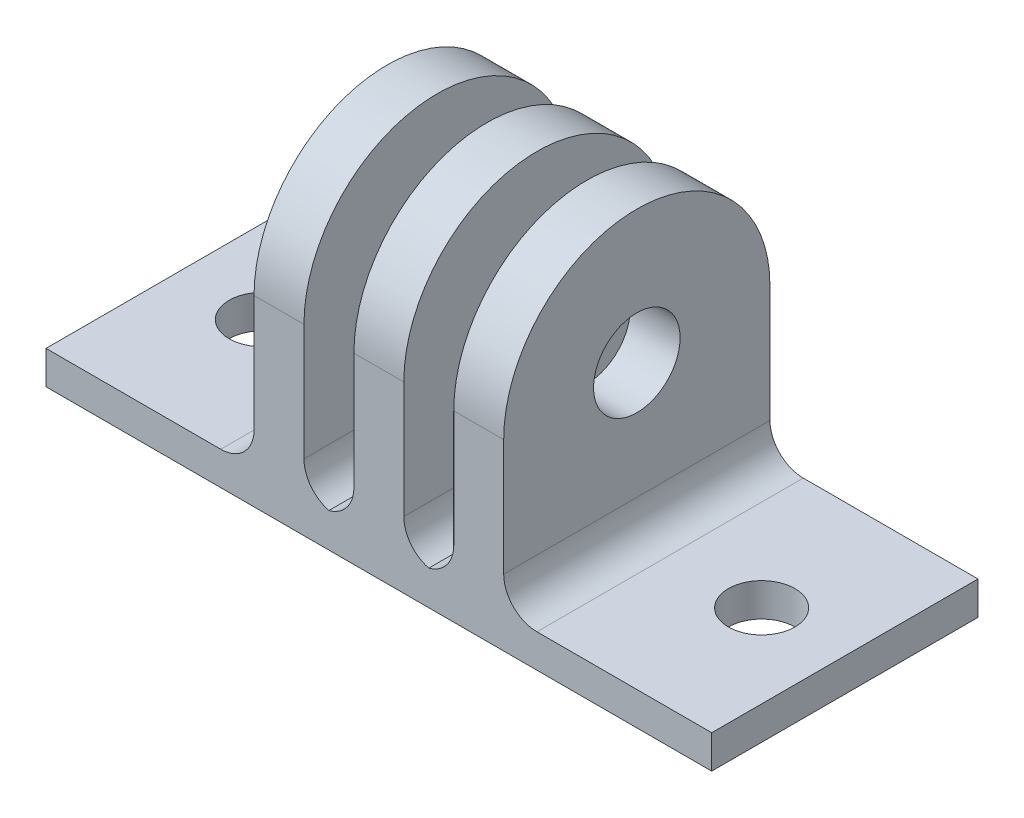
ISO-10303-21;
HEADER;
FILE_DESCRIPTION(('STEP AP214'),'2;1');
FILE_NAME('part.step','',(''),(''),'','','');
FILE_SCHEMA(('AUTOMOTIVE_DESIGN { 1 0 10303 214 1 1 1 1 }'));
ENDSEC;
DATA;
#1=APPLICATION_CONTEXT('core data for automotive mechanical design processes');
#2=APPLICATION_PROTOCOL_DEFINITION('international standard','automotive_design',2000,#1);
#3=PRODUCT_CONTEXT('',#1,'mechanical');
#4=PRODUCT('Part','Part','',(#3));
#5=PRODUCT_RELATED_PRODUCT_CATEGORY('part','',(#4));
#6=PRODUCT_DEFINITION_FORMATION('','',#4);
#7=PRODUCT_DEFINITION_CONTEXT('part definition',#1,'design');
#8=PRODUCT_DEFINITION('design','',#6,#7);
#9=PRODUCT_DEFINITION_SHAPE('','',#8);
#10=(LENGTH_UNIT() NAMED_UNIT(*) SI_UNIT(.MILLI.,.METRE.));
#11=(NAMED_UNIT(*) PLANE_ANGLE_UNIT() SI_UNIT($,.RADIAN.));
#12=(NAMED_UNIT(*) SI_UNIT($,.STERADIAN.) SOLID_ANGLE_UNIT());
#13=UNCERTAINTY_MEASURE_WITH_UNIT(LENGTH_MEASURE(1.E-05),#10,'distance_accuracy_value','');
#14=(GEOMETRIC_REPRESENTATION_CONTEXT(3) GLOBAL_UNCERTAINTY_ASSIGNED_CONTEXT((#13)) GLOBAL_UNIT_ASSIGNED_CONTEXT((#10,
#11,#12)) REPRESENTATION_CONTEXT('',''));
#15=CARTESIAN_POINT('',(0.,0.,0.));
#16=DIRECTION('',(0.,0.,1.));
#17=DIRECTION('',(1.,0.,0.));
#18=AXIS2_PLACEMENT_3D('',#15,#16,#17);
#19=CARTESIAN_POINT('',(0.,2.,0.));
#20=DIRECTION('',(0.,-1.,0.));
#21=DIRECTION('',(0.,0.,-1.));
#22=AXIS2_PLACEMENT_3D('',#19,#20,#21);
#23=PLANE('',#22);
#24=CARTESIAN_POINT('',(-15.,2.,0.));
#25=DIRECTION('',(0.,1.,0.));
#26=DIRECTION('',(0.,0.,1.));
#27=AXIS2_PLACEMENT_3D('',#24,#25,#26);
#28=CIRCLE('',#27,2.);
#29=CARTESIAN_POINT('',(-15.,2.,2.));
#30=VERTEX_POINT('',#29);
#31=EDGE_CURVE('E273',#30,#30,#28,.T.);
#32=ORIENTED_EDGE('',*,*,#31,.F.);
#33=EDGE_LOOP('',(#32));
#34=FACE_BOUND('',#33,.T.);
#35=DIRECTION('',(1.,0.,0.));
#36=VECTOR('',#35,1.);
#37=CARTESIAN_POINT('',(-20.,2.,8.));
#38=LINE('',#37,#36);
#39=CARTESIAN_POINT('',(-20.,2.,8.));
#40=VERTEX_POINT('',#39);
#41=CARTESIAN_POINT('',(-9.5,2.,8.));
#42=VERTEX_POINT('',#41);
#43=EDGE_CURVE('E290',#40,#42,#38,.T.);
#44=ORIENTED_EDGE('',*,*,#43,.T.);
#45=DIRECTION('',(0.,0.,1.));
#46=VECTOR('',#45,1.);
#47=CARTESIAN_POINT('',(-9.5,2.,-7.99999999999999));
#48=LINE('',#47,#46);
#49=CARTESIAN_POINT('',(-9.5,2.,-7.99999999999999));
#50=VERTEX_POINT('',#49);
#51=EDGE_CURVE('E315',#42,#50,#48,.F.);
#52=ORIENTED_EDGE('',*,*,#51,.T.);
#53=DIRECTION('',(-1.,0.,0.));
#54=VECTOR('',#53,1.);
#55=CARTESIAN_POINT('',(-20.,2.,-7.99999999999999));
#56=LINE('',#55,#54);
#57=CARTESIAN_POINT('',(-20.,2.,-7.99999999999999));
#58=VERTEX_POINT('',#57);
#59=EDGE_CURVE('E282',#50,#58,#56,.T.);
#60=ORIENTED_EDGE('',*,*,#59,.T.);
#61=DIRECTION('',(0.,0.,1.));
#62=VECTOR('',#61,1.);
#63=CARTESIAN_POINT('',(-20.,2.,8.));
#64=LINE('',#63,#62);
#65=EDGE_CURVE('E287',#58,#40,#64,.T.);
#66=ORIENTED_EDGE('',*,*,#65,.T.);
#67=EDGE_LOOP('',(#44,#52,#60,#66));
#68=FACE_BOUND('',#67,.T.);
#69=ADVANCED_FACE('F37',(#34,#68),#23,.F.);
#70=CARTESIAN_POINT('',(20.,2.,-7.99999999999999));
#71=VERTEX_POINT('',#70);
#72=CARTESIAN_POINT('',(9.5,2.,-7.99999999999999));
#73=VERTEX_POINT('',#72);
#74=EDGE_CURVE('E284',#71,#73,#56,.T.);
#75=ORIENTED_EDGE('',*,*,#74,.T.);
#76=DIRECTION('',(0.,0.,1.));
#77=VECTOR('',#76,1.);
#78=CARTESIAN_POINT('',(9.5,2.,0.));
#79=LINE('',#78,#77);
#80=CARTESIAN_POINT('',(9.5,2.,8.));
#81=VERTEX_POINT('',#80);
#82=EDGE_CURVE('E327',#73,#81,#79,.T.);
#83=ORIENTED_EDGE('',*,*,#82,.T.);
#84=CARTESIAN_POINT('',(20.,2.,7.99999999999999));
#85=VERTEX_POINT('',#84);
#86=EDGE_CURVE('E289',#81,#85,#38,.T.);
#87=ORIENTED_EDGE('',*,*,#86,.T.);
#88=DIRECTION('',(0.,0.,-1.));
#89=VECTOR('',#88,1.);
#90=CARTESIAN_POINT('',(20.,2.,7.99999999999999));
#91=LINE('',#90,#89);
#92=EDGE_CURVE('E279',#85,#71,#91,.T.);
#93=ORIENTED_EDGE('',*,*,#92,.T.);
#94=EDGE_LOOP('',(#75,#83,#87,#93));
#95=FACE_BOUND('',#94,.T.);
#96=CARTESIAN_POINT('',(15.,2.,0.));
#97=DIRECTION('',(0.,1.,0.));
#98=DIRECTION('',(0.,0.,-1.));
#99=AXIS2_PLACEMENT_3D('',#96,#97,#98);
#100=CIRCLE('',#99,2.);
#101=CARTESIAN_POINT('',(15.,2.,-2.));
#102=VERTEX_POINT('',#101);
#103=EDGE_CURVE('E267',#102,#102,#100,.T.);
#104=ORIENTED_EDGE('',*,*,#103,.F.);
#105=EDGE_LOOP('',(#104));
#106=FACE_BOUND('',#105,.T.);
#107=ADVANCED_FACE('F382',(#95,#106),#23,.F.);
#108=CARTESIAN_POINT('',(0.,0.,0.));
#109=DIRECTION('',(0.,-1.,0.));
#110=DIRECTION('',(0.,0.,-1.));
#111=AXIS2_PLACEMENT_3D('',#108,#109,#110);
#112=PLANE('',#111);
#113=CARTESIAN_POINT('',(-15.,0.,0.));
#114=DIRECTION('',(0.,1.,0.));
#115=DIRECTION('',(0.,0.,1.));
#116=AXIS2_PLACEMENT_3D('',#113,#114,#115);
#117=CIRCLE('',#116,2.);
#118=CARTESIAN_POINT('',(-15.,0.,2.));
#119=VERTEX_POINT('',#118);
#120=EDGE_CURVE('E270',#119,#119,#117,.T.);
#121=ORIENTED_EDGE('',*,*,#120,.T.);
#122=EDGE_LOOP('',(#121));
#123=FACE_BOUND('',#122,.T.);
#124=DIRECTION('',(0.,0.,-1.));
#125=VECTOR('',#124,1.);
#126=CARTESIAN_POINT('',(20.,0.,7.99999999999999));
#127=LINE('',#126,#125);
#128=CARTESIAN_POINT('',(20.,0.,7.99999999999999));
#129=VERTEX_POINT('',#128);
#130=CARTESIAN_POINT('',(20.,0.,-7.99999999999999));
#131=VERTEX_POINT('',#130);
#132=EDGE_CURVE('E276',#129,#131,#127,.T.);
#133=ORIENTED_EDGE('',*,*,#132,.F.);
#134=DIRECTION('',(1.,0.,0.));
#135=VECTOR('',#134,1.);
#136=CARTESIAN_POINT('',(-20.,0.,8.));
#137=LINE('',#136,#135);
#138=CARTESIAN_POINT('',(-20.,0.,8.));
#139=VERTEX_POINT('',#138);
#140=EDGE_CURVE('E283',#139,#129,#137,.T.);
#141=ORIENTED_EDGE('',*,*,#140,.F.);
#142=DIRECTION('',(0.,0.,1.));
#143=VECTOR('',#142,1.);
#144=CARTESIAN_POINT('',(-20.,0.,8.));
#145=LINE('',#144,#143);
#146=CARTESIAN_POINT('',(-20.,0.,-7.99999999999999));
#147=VERTEX_POINT('',#146);
#148=EDGE_CURVE('E298',#147,#139,#145,.T.);
#149=ORIENTED_EDGE('',*,*,#148,.F.);
#150=DIRECTION('',(-1.,0.,0.));
#151=VECTOR('',#150,1.);
#152=CARTESIAN_POINT('',(-20.,0.,-7.99999999999999));
#153=LINE('',#152,#151);
#154=EDGE_CURVE('E296',#131,#147,#153,.T.);
#155=ORIENTED_EDGE('',*,*,#154,.F.);
#156=EDGE_LOOP('',(#133,#141,#149,#155));
#157=FACE_BOUND('',#156,.T.);
#158=CARTESIAN_POINT('',(15.,0.,0.));
#159=DIRECTION('',(0.,1.,0.));
#160=DIRECTION('',(0.,0.,-1.));
#161=AXIS2_PLACEMENT_3D('',#158,#159,#160);
#162=CIRCLE('',#161,2.);
#163=CARTESIAN_POINT('',(15.,0.,-2.));
#164=VERTEX_POINT('',#163);
#165=EDGE_CURVE('E266',#164,#164,#162,.T.);
#166=ORIENTED_EDGE('',*,*,#165,.T.);
#167=EDGE_LOOP('',(#166));
#168=FACE_BOUND('',#167,.T.);
#169=ADVANCED_FACE('F388',(#123,#157,#168),#112,.T.);
#170=CARTESIAN_POINT('',(20.,2.,7.99999999999999));
#171=DIRECTION('',(-1.,0.,0.));
#172=DIRECTION('',(0.,0.,1.));
#173=AXIS2_PLACEMENT_3D('',#170,#171,#172);
#174=PLANE('',#173);
#175=ORIENTED_EDGE('',*,*,#132,.T.);
#176=DIRECTION('',(0.,-1.,0.));
#177=VECTOR('',#176,1.);
#178=CARTESIAN_POINT('',(20.,2.,-7.99999999999999));
#179=LINE('',#178,#177);
#180=EDGE_CURVE('E309',#71,#131,#179,.T.);
#181=ORIENTED_EDGE('',*,*,#180,.F.);
#182=ORIENTED_EDGE('',*,*,#92,.F.);
#183=DIRECTION('',(0.,-1.,0.));
#184=VECTOR('',#183,1.);
#185=CARTESIAN_POINT('',(20.,2.,7.99999999999999));
#186=LINE('',#185,#184);
#187=EDGE_CURVE('E293',#85,#129,#186,.T.);
#188=ORIENTED_EDGE('',*,*,#187,.T.);
#189=EDGE_LOOP('',(#175,#181,#182,#188));
#190=FACE_BOUND('',#189,.T.);
#191=ADVANCED_FACE('F398',(#190),#174,.F.);
#192=CARTESIAN_POINT('',(-20.,2.,-7.99999999999999));
#193=DIRECTION('',(0.,0.,1.));
#194=DIRECTION('',(1.,0.,0.));
#195=AXIS2_PLACEMENT_3D('',#192,#193,#194);
#196=PLANE('',#195);
#197=CARTESIAN_POINT('',(-2.5,4.,-7.99999999999999));
#198=DIRECTION('',(0.,0.,1.));
#199=DIRECTION('',(1.,0.,0.));
#200=AXIS2_PLACEMENT_3D('',#197,#198,#199);
#201=CIRCLE('',#200,2.);
#202=CARTESIAN_POINT('',(-4.5,4.,-7.99999999999999));
#203=VERTEX_POINT('',#202);
#204=CARTESIAN_POINT('',(-3.,2.06350832689629,-7.99999999999999));
#205=VERTEX_POINT('',#204);
#206=EDGE_CURVE('E338',#203,#205,#201,.T.);
#207=ORIENTED_EDGE('',*,*,#206,.T.);
#208=CARTESIAN_POINT('',(-3.5,4.,-7.99999999999999));
#209=DIRECTION('',(0.,0.,1.));
#210=DIRECTION('',(1.,0.,0.));
#211=AXIS2_PLACEMENT_3D('',#208,#209,#210);
#212=CIRCLE('',#211,2.);
#213=CARTESIAN_POINT('',(-1.5,4.,-7.99999999999999));
#214=VERTEX_POINT('',#213);
#215=EDGE_CURVE('E342',#205,#214,#212,.T.);
#216=ORIENTED_EDGE('',*,*,#215,.T.);
#217=DIRECTION('',(0.,1.,0.));
#218=VECTOR('',#217,1.);
#219=CARTESIAN_POINT('',(-1.5,0.,-8.));
#220=LINE('',#219,#218);
#221=CARTESIAN_POINT('',(-1.5,11.,-7.99999999999999));
#222=VERTEX_POINT('',#221);
#223=EDGE_CURVE('E245',#214,#222,#220,.T.);
#224=ORIENTED_EDGE('',*,*,#223,.T.);
#225=DIRECTION('',(-1.,0.,0.));
#226=VECTOR('',#225,1.);
#227=CARTESIAN_POINT('',(1.5,11.,-7.99999999999999));
#228=LINE('',#227,#226);
#229=CARTESIAN_POINT('',(1.5,11.,-7.99999999999999));
#230=VERTEX_POINT('',#229);
#231=EDGE_CURVE('E252',#230,#222,#228,.T.);
#232=ORIENTED_EDGE('',*,*,#231,.F.);
#233=DIRECTION('',(0.,1.,0.));
#234=VECTOR('',#233,1.);
#235=CARTESIAN_POINT('',(1.5,0.,-8.));
#236=LINE('',#235,#234);
#237=CARTESIAN_POINT('',(1.5,4.,-7.99999999999999));
#238=VERTEX_POINT('',#237);
#239=EDGE_CURVE('E250',#238,#230,#236,.T.);
#240=ORIENTED_EDGE('',*,*,#239,.F.);
#241=CARTESIAN_POINT('',(3.5,4.,-7.99999999999999));
#242=DIRECTION('',(0.,0.,1.));
#243=DIRECTION('',(1.,0.,0.));
#244=AXIS2_PLACEMENT_3D('',#241,#242,#243);
#245=CIRCLE('',#244,2.);
#246=CARTESIAN_POINT('',(3.,2.06350832689629,-7.99999999999999));
#247=VERTEX_POINT('',#246);
#248=EDGE_CURVE('E54',#238,#247,#245,.T.);
#249=ORIENTED_EDGE('',*,*,#248,.T.);
#250=CARTESIAN_POINT('',(2.5,4.,-7.99999999999999));
#251=DIRECTION('',(0.,0.,1.));
#252=DIRECTION('',(1.,0.,0.));
#253=AXIS2_PLACEMENT_3D('',#250,#251,#252);
#254=CIRCLE('',#253,2.);
#255=CARTESIAN_POINT('',(4.5,4.,-7.99999999999999));
#256=VERTEX_POINT('',#255);
#257=EDGE_CURVE('E348',#247,#256,#254,.T.);
#258=ORIENTED_EDGE('',*,*,#257,.T.);
#259=DIRECTION('',(0.,1.,0.));
#260=VECTOR('',#259,1.);
#261=CARTESIAN_POINT('',(4.5,0.,-8.));
#262=LINE('',#261,#260);
#263=CARTESIAN_POINT('',(4.5,11.,-7.99999999999999));
#264=VERTEX_POINT('',#263);
#265=EDGE_CURVE('E202',#256,#264,#262,.T.);
#266=ORIENTED_EDGE('',*,*,#265,.T.);
#267=DIRECTION('',(-1.,0.,0.));
#268=VECTOR('',#267,1.);
#269=CARTESIAN_POINT('',(7.5,11.,-7.99999999999999));
#270=LINE('',#269,#268);
#271=CARTESIAN_POINT('',(7.5,11.,-7.99999999999999));
#272=VERTEX_POINT('',#271);
#273=EDGE_CURVE('E194',#272,#264,#270,.T.);
#274=ORIENTED_EDGE('',*,*,#273,.F.);
#275=DIRECTION('',(0.,1.,0.));
#276=VECTOR('',#275,1.);
#277=CARTESIAN_POINT('',(7.5,0.,-8.));
#278=LINE('',#277,#276);
#279=CARTESIAN_POINT('',(7.5,4.,-7.99999999999999));
#280=VERTEX_POINT('',#279);
#281=EDGE_CURVE('E184',#280,#272,#278,.T.);
#282=ORIENTED_EDGE('',*,*,#281,.F.);
#283=CARTESIAN_POINT('',(9.5,4.,-7.99999999999999));
#284=DIRECTION('',(0.,0.,1.));
#285=DIRECTION('',(1.,0.,0.));
#286=AXIS2_PLACEMENT_3D('',#283,#284,#285);
#287=CIRCLE('',#286,2.);
#288=EDGE_CURVE('E11',#280,#73,#287,.T.);
#289=ORIENTED_EDGE('',*,*,#288,.T.);
#290=ORIENTED_EDGE('',*,*,#74,.F.);
#291=ORIENTED_EDGE('',*,*,#180,.T.);
#292=ORIENTED_EDGE('',*,*,#154,.T.);
#293=DIRECTION('',(0.,-1.,0.));
#294=VECTOR('',#293,1.);
#295=CARTESIAN_POINT('',(-20.,2.,-7.99999999999999));
#296=LINE('',#295,#294);
#297=EDGE_CURVE('E306',#58,#147,#296,.T.);
#298=ORIENTED_EDGE('',*,*,#297,.F.);
#299=ORIENTED_EDGE('',*,*,#59,.F.);
#300=CARTESIAN_POINT('',(-9.5,4.,-7.99999999999999));
#301=DIRECTION('',(0.,0.,1.));
#302=DIRECTION('',(1.,0.,0.));
#303=AXIS2_PLACEMENT_3D('',#300,#301,#302);
#304=CIRCLE('',#303,2.);
#305=CARTESIAN_POINT('',(-7.5,4.,-7.99999999999999));
#306=VERTEX_POINT('',#305);
#307=EDGE_CURVE('E334',#50,#306,#304,.T.);
#308=ORIENTED_EDGE('',*,*,#307,.T.);
#309=DIRECTION('',(0.,1.,0.));
#310=VECTOR('',#309,1.);
#311=CARTESIAN_POINT('',(-7.5,0.,-8.));
#312=LINE('',#311,#310);
#313=CARTESIAN_POINT('',(-7.5,11.,-7.99999999999999));
#314=VERTEX_POINT('',#313);
#315=EDGE_CURVE('E219',#306,#314,#312,.T.);
#316=ORIENTED_EDGE('',*,*,#315,.T.);
#317=DIRECTION('',(-1.,0.,0.));
#318=VECTOR('',#317,1.);
#319=CARTESIAN_POINT('',(-4.5,11.,-7.99999999999999));
#320=LINE('',#319,#318);
#321=CARTESIAN_POINT('',(-4.5,11.,-7.99999999999999));
#322=VERTEX_POINT('',#321);
#323=EDGE_CURVE('E226',#322,#314,#320,.T.);
#324=ORIENTED_EDGE('',*,*,#323,.F.);
#325=DIRECTION('',(0.,1.,0.));
#326=VECTOR('',#325,1.);
#327=CARTESIAN_POINT('',(-4.5,0.,-8.));
#328=LINE('',#327,#326);
#329=EDGE_CURVE('E224',#203,#322,#328,.T.);
#330=ORIENTED_EDGE('',*,*,#329,.F.);
#331=EDGE_LOOP('',(#207,#216,#224,#232,#240,#249,#258,#266,#274,#282,#289,#290,#291,#292,#298,
#299,#308,#316,#324,#330));
#332=FACE_BOUND('',#331,.T.);
#333=ADVANCED_FACE('F363',(#332),#196,.F.);
#334=CARTESIAN_POINT('',(-20.,2.,8.));
#335=DIRECTION('',(1.,0.,0.));
#336=DIRECTION('',(0.,0.,-1.));
#337=AXIS2_PLACEMENT_3D('',#334,#335,#336);
#338=PLANE('',#337);
#339=ORIENTED_EDGE('',*,*,#148,.T.);
#340=DIRECTION('',(0.,-1.,0.));
#341=VECTOR('',#340,1.);
#342=CARTESIAN_POINT('',(-20.,2.,8.));
#343=LINE('',#342,#341);
#344=EDGE_CURVE('E303',#40,#139,#343,.T.);
#345=ORIENTED_EDGE('',*,*,#344,.F.);
#346=ORIENTED_EDGE('',*,*,#65,.F.);
#347=ORIENTED_EDGE('',*,*,#297,.T.);
#348=EDGE_LOOP('',(#339,#345,#346,#347));
#349=FACE_BOUND('',#348,.T.);
#350=ADVANCED_FACE('F402',(#349),#338,.F.);
#351=CARTESIAN_POINT('',(-20.,2.,8.));
#352=DIRECTION('',(0.,0.,-1.));
#353=DIRECTION('',(-1.,0.,0.));
#354=AXIS2_PLACEMENT_3D('',#351,#352,#353);
#355=PLANE('',#354);
#356=DIRECTION('',(0.,1.,0.));
#357=VECTOR('',#356,1.);
#358=CARTESIAN_POINT('',(4.5,0.,8.));
#359=LINE('',#358,#357);
#360=CARTESIAN_POINT('',(4.5,4.,8.));
#361=VERTEX_POINT('',#360);
#362=CARTESIAN_POINT('',(4.5,11.,8.));
#363=VERTEX_POINT('',#362);
#364=EDGE_CURVE('E211',#361,#363,#359,.T.);
#365=ORIENTED_EDGE('',*,*,#364,.F.);
#366=CARTESIAN_POINT('',(2.5,4.,8.));
#367=DIRECTION('',(0.,0.,-1.));
#368=DIRECTION('',(-1.,0.,0.));
#369=AXIS2_PLACEMENT_3D('',#366,#367,#368);
#370=CIRCLE('',#369,2.);
#371=CARTESIAN_POINT('',(3.,2.06350832689629,8.));
#372=VERTEX_POINT('',#371);
#373=EDGE_CURVE('E62',#361,#372,#370,.T.);
#374=ORIENTED_EDGE('',*,*,#373,.T.);
#375=CARTESIAN_POINT('',(3.5,4.,8.));
#376=DIRECTION('',(0.,0.,-1.));
#377=DIRECTION('',(-1.,0.,0.));
#378=AXIS2_PLACEMENT_3D('',#375,#376,#377);
#379=CIRCLE('',#378,2.);
#380=CARTESIAN_POINT('',(1.5,4.,8.));
#381=VERTEX_POINT('',#380);
#382=EDGE_CURVE('E344',#372,#381,#379,.T.);
#383=ORIENTED_EDGE('',*,*,#382,.T.);
#384=DIRECTION('',(0.,1.,0.));
#385=VECTOR('',#384,1.);
#386=CARTESIAN_POINT('',(1.5,0.,8.));
#387=LINE('',#386,#385);
#388=CARTESIAN_POINT('',(1.5,11.,8.));
#389=VERTEX_POINT('',#388);
#390=EDGE_CURVE('E248',#381,#389,#387,.T.);
#391=ORIENTED_EDGE('',*,*,#390,.T.);
#392=DIRECTION('',(-1.,0.,0.));
#393=VECTOR('',#392,1.);
#394=CARTESIAN_POINT('',(1.5,11.,8.));
#395=LINE('',#394,#393);
#396=CARTESIAN_POINT('',(-1.5,11.,8.));
#397=VERTEX_POINT('',#396);
#398=EDGE_CURVE('E263',#389,#397,#395,.T.);
#399=ORIENTED_EDGE('',*,*,#398,.T.);
#400=DIRECTION('',(0.,1.,0.));
#401=VECTOR('',#400,1.);
#402=CARTESIAN_POINT('',(-1.5,0.,8.));
#403=LINE('',#402,#401);
#404=CARTESIAN_POINT('',(-1.5,4.,8.));
#405=VERTEX_POINT('',#404);
#406=EDGE_CURVE('E258',#405,#397,#403,.T.);
#407=ORIENTED_EDGE('',*,*,#406,.F.);
#408=CARTESIAN_POINT('',(-3.5,4.,8.));
#409=DIRECTION('',(0.,0.,-1.));
#410=DIRECTION('',(-1.,0.,0.));
#411=AXIS2_PLACEMENT_3D('',#408,#409,#410);
#412=CIRCLE('',#411,2.);
#413=CARTESIAN_POINT('',(-3.,2.06350832689629,8.));
#414=VERTEX_POINT('',#413);
#415=EDGE_CURVE('E340',#405,#414,#412,.T.);
#416=ORIENTED_EDGE('',*,*,#415,.T.);
#417=CARTESIAN_POINT('',(-2.5,4.,8.));
#418=DIRECTION('',(0.,0.,-1.));
#419=DIRECTION('',(-1.,0.,0.));
#420=AXIS2_PLACEMENT_3D('',#417,#418,#419);
#421=CIRCLE('',#420,2.);
#422=CARTESIAN_POINT('',(-4.5,4.,8.));
#423=VERTEX_POINT('',#422);
#424=EDGE_CURVE('E336',#414,#423,#421,.T.);
#425=ORIENTED_EDGE('',*,*,#424,.T.);
#426=DIRECTION('',(0.,1.,0.));
#427=VECTOR('',#426,1.);
#428=CARTESIAN_POINT('',(-4.5,0.,8.));
#429=LINE('',#428,#427);
#430=CARTESIAN_POINT('',(-4.5,11.,8.));
#431=VERTEX_POINT('',#430);
#432=EDGE_CURVE('E222',#423,#431,#429,.T.);
#433=ORIENTED_EDGE('',*,*,#432,.T.);
#434=DIRECTION('',(-1.,0.,0.));
#435=VECTOR('',#434,1.);
#436=CARTESIAN_POINT('',(-4.5,11.,8.));
#437=LINE('',#436,#435);
#438=CARTESIAN_POINT('',(-7.5,11.,8.));
#439=VERTEX_POINT('',#438);
#440=EDGE_CURVE('E237',#431,#439,#437,.T.);
#441=ORIENTED_EDGE('',*,*,#440,.T.);
#442=DIRECTION('',(0.,1.,0.));
#443=VECTOR('',#442,1.);
#444=CARTESIAN_POINT('',(-7.5,0.,8.));
#445=LINE('',#444,#443);
#446=CARTESIAN_POINT('',(-7.5,4.,8.));
#447=VERTEX_POINT('',#446);
#448=EDGE_CURVE('E232',#447,#439,#445,.T.);
#449=ORIENTED_EDGE('',*,*,#448,.F.);
#450=CARTESIAN_POINT('',(-9.5,4.,8.));
#451=DIRECTION('',(0.,0.,-1.));
#452=DIRECTION('',(-1.,0.,0.));
#453=AXIS2_PLACEMENT_3D('',#450,#451,#452);
#454=CIRCLE('',#453,2.);
#455=EDGE_CURVE('E332',#447,#42,#454,.T.);
#456=ORIENTED_EDGE('',*,*,#455,.T.);
#457=ORIENTED_EDGE('',*,*,#43,.F.);
#458=ORIENTED_EDGE('',*,*,#344,.T.);
#459=ORIENTED_EDGE('',*,*,#140,.T.);
#460=ORIENTED_EDGE('',*,*,#187,.F.);
#461=ORIENTED_EDGE('',*,*,#86,.F.);
#462=CARTESIAN_POINT('',(9.5,4.,8.));
#463=DIRECTION('',(0.,0.,-1.));
#464=DIRECTION('',(-1.,0.,0.));
#465=AXIS2_PLACEMENT_3D('',#462,#463,#464);
#466=CIRCLE('',#465,2.);
#467=CARTESIAN_POINT('',(7.5,4.,8.));
#468=VERTEX_POINT('',#467);
#469=EDGE_CURVE('E46',#81,#468,#466,.T.);
#470=ORIENTED_EDGE('',*,*,#469,.T.);
#471=DIRECTION('',(0.,1.,0.));
#472=VECTOR('',#471,1.);
#473=CARTESIAN_POINT('',(7.5,0.,8.));
#474=LINE('',#473,#472);
#475=CARTESIAN_POINT('',(7.5,11.,8.));
#476=VERTEX_POINT('',#475);
#477=EDGE_CURVE('E175',#468,#476,#474,.T.);
#478=ORIENTED_EDGE('',*,*,#477,.T.);
#479=DIRECTION('',(-1.,0.,0.));
#480=VECTOR('',#479,1.);
#481=CARTESIAN_POINT('',(7.5,11.,8.));
#482=LINE('',#481,#480);
#483=EDGE_CURVE('E178',#476,#363,#482,.T.);
#484=ORIENTED_EDGE('',*,*,#483,.T.);
#485=EDGE_LOOP('',(#365,#374,#383,#391,#399,#407,#416,#425,#433,#441,#449,#456,#457,#458,#459,
#460,#461,#470,#478,#484));
#486=FACE_BOUND('',#485,.T.);
#487=ADVANCED_FACE('F177',(#486),#355,.F.);
#488=CARTESIAN_POINT('',(-15.,2.,0.));
#489=DIRECTION('',(0.,-1.,0.));
#490=DIRECTION('',(0.,0.,-1.));
#491=AXIS2_PLACEMENT_3D('',#488,#489,#490);
#492=CYLINDRICAL_SURFACE('',#491,2.);
#493=ORIENTED_EDGE('',*,*,#31,.T.);
#494=EDGE_LOOP('',(#493));
#495=FACE_BOUND('',#494,.T.);
#496=ORIENTED_EDGE('',*,*,#120,.F.);
#497=EDGE_LOOP('',(#496));
#498=FACE_BOUND('',#497,.T.);
#499=ADVANCED_FACE('F394',(#495,#498),#492,.F.);
#500=CARTESIAN_POINT('',(15.,2.,0.));
#501=DIRECTION('',(0.,-1.,0.));
#502=DIRECTION('',(0.,0.,-1.));
#503=AXIS2_PLACEMENT_3D('',#500,#501,#502);
#504=CYLINDRICAL_SURFACE('',#503,2.);
#505=ORIENTED_EDGE('',*,*,#103,.T.);
#506=EDGE_LOOP('',(#505));
#507=FACE_BOUND('',#506,.T.);
#508=ORIENTED_EDGE('',*,*,#165,.F.);
#509=EDGE_LOOP('',(#508));
#510=FACE_BOUND('',#509,.T.);
#511=ADVANCED_FACE('F598',(#507,#510),#504,.F.);
#512=CARTESIAN_POINT('',(1.5,11.,0.));
#513=DIRECTION('',(-1.,0.,0.));
#514=DIRECTION('',(0.,0.,1.));
#515=AXIS2_PLACEMENT_3D('',#512,#513,#514);
#516=CYLINDRICAL_SURFACE('',#515,7.99999999999999);
#517=CARTESIAN_POINT('',(-1.5,11.,0.));
#518=DIRECTION('',(1.,0.,0.));
#519=DIRECTION('',(0.,0.,-1.));
#520=AXIS2_PLACEMENT_3D('',#517,#518,#519);
#521=CIRCLE('',#520,7.99999999999999);
#522=EDGE_CURVE('E255',#397,#222,#521,.F.);
#523=ORIENTED_EDGE('',*,*,#522,.F.);
#524=ORIENTED_EDGE('',*,*,#398,.F.);
#525=CARTESIAN_POINT('',(1.5,11.,0.));
#526=DIRECTION('',(1.,0.,0.));
#527=DIRECTION('',(0.,0.,-1.));
#528=AXIS2_PLACEMENT_3D('',#525,#526,#527);
#529=CIRCLE('',#528,7.99999999999999);
#530=EDGE_CURVE('E244',#389,#230,#529,.F.);
#531=ORIENTED_EDGE('',*,*,#530,.T.);
#532=ORIENTED_EDGE('',*,*,#231,.T.);
#533=EDGE_LOOP('',(#523,#524,#531,#532));
#534=FACE_BOUND('',#533,.T.);
#535=ADVANCED_FACE('F587',(#534),#516,.T.);
#536=CARTESIAN_POINT('',(1.5,11.,0.));
#537=DIRECTION('',(-1.,0.,0.));
#538=DIRECTION('',(0.,0.,1.));
#539=AXIS2_PLACEMENT_3D('',#536,#537,#538);
#540=CYLINDRICAL_SURFACE('',#539,2.6);
#541=CARTESIAN_POINT('',(1.5,11.,0.));
#542=DIRECTION('',(1.,0.,0.));
#543=DIRECTION('',(0.,0.,-1.));
#544=AXIS2_PLACEMENT_3D('',#541,#542,#543);
#545=CIRCLE('',#544,2.6);
#546=CARTESIAN_POINT('',(1.5,11.,-2.6));
#547=VERTEX_POINT('',#546);
#548=EDGE_CURVE('E241',#547,#547,#545,.T.);
#549=ORIENTED_EDGE('',*,*,#548,.T.);
#550=EDGE_LOOP('',(#549));
#551=FACE_BOUND('',#550,.T.);
#552=CARTESIAN_POINT('',(-1.5,11.,0.));
#553=DIRECTION('',(1.,0.,0.));
#554=DIRECTION('',(0.,0.,-1.));
#555=AXIS2_PLACEMENT_3D('',#552,#553,#554);
#556=CIRCLE('',#555,2.6);
#557=CARTESIAN_POINT('',(-1.5,11.,-2.6));
#558=VERTEX_POINT('',#557);
#559=EDGE_CURVE('E240',#558,#558,#556,.T.);
#560=ORIENTED_EDGE('',*,*,#559,.F.);
#561=EDGE_LOOP('',(#560));
#562=FACE_BOUND('',#561,.T.);
#563=ADVANCED_FACE('F519',(#551,#562),#540,.F.);
#564=CARTESIAN_POINT('',(1.5,0.,0.));
#565=DIRECTION('',(1.,0.,0.));
#566=DIRECTION('',(0.,0.,-1.));
#567=AXIS2_PLACEMENT_3D('',#564,#565,#566);
#568=PLANE('',#567);
#569=ORIENTED_EDGE('',*,*,#548,.F.);
#570=EDGE_LOOP('',(#569));
#571=FACE_BOUND('',#570,.T.);
#572=ORIENTED_EDGE('',*,*,#390,.F.);
#573=DIRECTION('',(0.,0.,1.));
#574=VECTOR('',#573,1.);
#575=CARTESIAN_POINT('',(1.5,4.,0.));
#576=LINE('',#575,#574);
#577=EDGE_CURVE('E322',#381,#238,#576,.F.);
#578=ORIENTED_EDGE('',*,*,#577,.T.);
#579=ORIENTED_EDGE('',*,*,#239,.T.);
#580=ORIENTED_EDGE('',*,*,#530,.F.);
#581=EDGE_LOOP('',(#572,#578,#579,#580));
#582=FACE_BOUND('',#581,.T.);
#583=ADVANCED_FACE('F506',(#571,#582),#568,.T.);
#584=CARTESIAN_POINT('',(-1.5,0.,0.));
#585=DIRECTION('',(1.,0.,0.));
#586=DIRECTION('',(0.,0.,-1.));
#587=AXIS2_PLACEMENT_3D('',#584,#585,#586);
#588=PLANE('',#587);
#589=ORIENTED_EDGE('',*,*,#559,.T.);
#590=EDGE_LOOP('',(#589));
#591=FACE_BOUND('',#590,.T.);
#592=ORIENTED_EDGE('',*,*,#223,.F.);
#593=DIRECTION('',(0.,0.,1.));
#594=VECTOR('',#593,1.);
#595=CARTESIAN_POINT('',(-1.5,4.,8.));
#596=LINE('',#595,#594);
#597=EDGE_CURVE('E320',#214,#405,#596,.T.);
#598=ORIENTED_EDGE('',*,*,#597,.T.);
#599=ORIENTED_EDGE('',*,*,#406,.T.);
#600=ORIENTED_EDGE('',*,*,#522,.T.);
#601=EDGE_LOOP('',(#592,#598,#599,#600));
#602=FACE_BOUND('',#601,.T.);
#603=ADVANCED_FACE('F500',(#591,#602),#588,.F.);
#604=CARTESIAN_POINT('',(-4.5,11.,0.));
#605=DIRECTION('',(-1.,0.,0.));
#606=DIRECTION('',(0.,0.,1.));
#607=AXIS2_PLACEMENT_3D('',#604,#605,#606);
#608=CYLINDRICAL_SURFACE('',#607,7.99999999999999);
#609=CARTESIAN_POINT('',(-7.5,11.,0.));
#610=DIRECTION('',(1.,0.,0.));
#611=DIRECTION('',(0.,0.,-1.));
#612=AXIS2_PLACEMENT_3D('',#609,#610,#611);
#613=CIRCLE('',#612,7.99999999999999);
#614=EDGE_CURVE('E229',#439,#314,#613,.F.);
#615=ORIENTED_EDGE('',*,*,#614,.F.);
#616=ORIENTED_EDGE('',*,*,#440,.F.);
#617=CARTESIAN_POINT('',(-4.5,11.,0.));
#618=DIRECTION('',(1.,0.,0.));
#619=DIRECTION('',(0.,0.,-1.));
#620=AXIS2_PLACEMENT_3D('',#617,#618,#619);
#621=CIRCLE('',#620,7.99999999999999);
#622=EDGE_CURVE('E218',#431,#322,#621,.F.);
#623=ORIENTED_EDGE('',*,*,#622,.T.);
#624=ORIENTED_EDGE('',*,*,#323,.T.);
#625=EDGE_LOOP('',(#615,#616,#623,#624));
#626=FACE_BOUND('',#625,.T.);
#627=ADVANCED_FACE('F505',(#626),#608,.T.);
#628=CARTESIAN_POINT('',(-4.5,11.,0.));
#629=DIRECTION('',(-1.,0.,0.));
#630=DIRECTION('',(0.,0.,1.));
#631=AXIS2_PLACEMENT_3D('',#628,#629,#630);
#632=CYLINDRICAL_SURFACE('',#631,2.6);
#633=CARTESIAN_POINT('',(-4.5,11.,0.));
#634=DIRECTION('',(1.,0.,0.));
#635=DIRECTION('',(0.,0.,-1.));
#636=AXIS2_PLACEMENT_3D('',#633,#634,#635);
#637=CIRCLE('',#636,2.6);
#638=CARTESIAN_POINT('',(-4.5,11.,-2.6));
#639=VERTEX_POINT('',#638);
#640=EDGE_CURVE('E215',#639,#639,#637,.T.);
#641=ORIENTED_EDGE('',*,*,#640,.T.);
#642=EDGE_LOOP('',(#641));
#643=FACE_BOUND('',#642,.T.);
#644=CARTESIAN_POINT('',(-7.5,11.,0.));
#645=DIRECTION('',(1.,0.,0.));
#646=DIRECTION('',(0.,0.,-1.));
#647=AXIS2_PLACEMENT_3D('',#644,#645,#646);
#648=CIRCLE('',#647,2.6);
#649=CARTESIAN_POINT('',(-7.5,11.,-2.6));
#650=VERTEX_POINT('',#649);
#651=EDGE_CURVE('E193',#650,#650,#648,.T.);
#652=ORIENTED_EDGE('',*,*,#651,.F.);
#653=EDGE_LOOP('',(#652));
#654=FACE_BOUND('',#653,.T.);
#655=ADVANCED_FACE('F491',(#643,#654),#632,.F.);
#656=CARTESIAN_POINT('',(-4.5,0.,0.));
#657=DIRECTION('',(1.,0.,0.));
#658=DIRECTION('',(0.,0.,-1.));
#659=AXIS2_PLACEMENT_3D('',#656,#657,#658);
#660=PLANE('',#659);
#661=ORIENTED_EDGE('',*,*,#640,.F.);
#662=EDGE_LOOP('',(#661));
#663=FACE_BOUND('',#662,.T.);
#664=ORIENTED_EDGE('',*,*,#432,.F.);
#665=DIRECTION('',(0.,0.,1.));
#666=VECTOR('',#665,1.);
#667=CARTESIAN_POINT('',(-4.5,4.,0.));
#668=LINE('',#667,#666);
#669=EDGE_CURVE('E317',#423,#203,#668,.F.);
#670=ORIENTED_EDGE('',*,*,#669,.T.);
#671=ORIENTED_EDGE('',*,*,#329,.T.);
#672=ORIENTED_EDGE('',*,*,#622,.F.);
#673=EDGE_LOOP('',(#664,#670,#671,#672));
#674=FACE_BOUND('',#673,.T.);
#675=ADVANCED_FACE('F478',(#663,#674),#660,.T.);
#676=CARTESIAN_POINT('',(-7.5,0.,0.));
#677=DIRECTION('',(1.,0.,0.));
#678=DIRECTION('',(0.,0.,-1.));
#679=AXIS2_PLACEMENT_3D('',#676,#677,#678);
#680=PLANE('',#679);
#681=ORIENTED_EDGE('',*,*,#651,.T.);
#682=EDGE_LOOP('',(#681));
#683=FACE_BOUND('',#682,.T.);
#684=ORIENTED_EDGE('',*,*,#315,.F.);
#685=DIRECTION('',(0.,0.,1.));
#686=VECTOR('',#685,1.);
#687=CARTESIAN_POINT('',(-7.5,4.,8.));
#688=LINE('',#687,#686);
#689=EDGE_CURVE('E312',#306,#447,#688,.T.);
#690=ORIENTED_EDGE('',*,*,#689,.T.);
#691=ORIENTED_EDGE('',*,*,#448,.T.);
#692=ORIENTED_EDGE('',*,*,#614,.T.);
#693=EDGE_LOOP('',(#684,#690,#691,#692));
#694=FACE_BOUND('',#693,.T.);
#695=ADVANCED_FACE('F473',(#683,#694),#680,.F.);
#696=CARTESIAN_POINT('',(7.5,11.,0.));
#697=DIRECTION('',(-1.,0.,0.));
#698=DIRECTION('',(0.,0.,1.));
#699=AXIS2_PLACEMENT_3D('',#696,#697,#698);
#700=CYLINDRICAL_SURFACE('',#699,7.99999999999999);
#701=CARTESIAN_POINT('',(4.5,11.,0.));
#702=DIRECTION('',(1.,0.,0.));
#703=DIRECTION('',(0.,0.,-1.));
#704=AXIS2_PLACEMENT_3D('',#701,#702,#703);
#705=CIRCLE('',#704,7.99999999999999);
#706=EDGE_CURVE('E192',#363,#264,#705,.F.);
#707=ORIENTED_EDGE('',*,*,#706,.F.);
#708=ORIENTED_EDGE('',*,*,#483,.F.);
#709=CARTESIAN_POINT('',(7.5,11.,0.));
#710=DIRECTION('',(1.,0.,0.));
#711=DIRECTION('',(0.,0.,-1.));
#712=AXIS2_PLACEMENT_3D('',#709,#710,#711);
#713=CIRCLE('',#712,7.99999999999999);
#714=EDGE_CURVE('E185',#476,#272,#713,.F.);
#715=ORIENTED_EDGE('',*,*,#714,.T.);
#716=ORIENTED_EDGE('',*,*,#273,.T.);
#717=EDGE_LOOP('',(#707,#708,#715,#716));
#718=FACE_BOUND('',#717,.T.);
#719=ADVANCED_FACE('F189',(#718),#700,.T.);
#720=CARTESIAN_POINT('',(7.5,11.,0.));
#721=DIRECTION('',(-1.,0.,0.));
#722=DIRECTION('',(0.,0.,1.));
#723=AXIS2_PLACEMENT_3D('',#720,#721,#722);
#724=CYLINDRICAL_SURFACE('',#723,2.6);
#725=CARTESIAN_POINT('',(7.5,11.,0.));
#726=DIRECTION('',(1.,0.,0.));
#727=DIRECTION('',(0.,0.,-1.));
#728=AXIS2_PLACEMENT_3D('',#725,#726,#727);
#729=CIRCLE('',#728,2.6);
#730=CARTESIAN_POINT('',(7.5,11.,-2.6));
#731=VERTEX_POINT('',#730);
#732=EDGE_CURVE('E199',#731,#731,#729,.T.);
#733=ORIENTED_EDGE('',*,*,#732,.T.);
#734=EDGE_LOOP('',(#733));
#735=FACE_BOUND('',#734,.T.);
#736=CARTESIAN_POINT('',(4.5,11.,0.));
#737=DIRECTION('',(1.,0.,0.));
#738=DIRECTION('',(0.,0.,-1.));
#739=AXIS2_PLACEMENT_3D('',#736,#737,#738);
#740=CIRCLE('',#739,2.6);
#741=CARTESIAN_POINT('',(4.5,11.,-2.6));
#742=VERTEX_POINT('',#741);
#743=EDGE_CURVE('E206',#742,#742,#740,.T.);
#744=ORIENTED_EDGE('',*,*,#743,.F.);
#745=EDGE_LOOP('',(#744));
#746=FACE_BOUND('',#745,.T.);
#747=ADVANCED_FACE('F377',(#735,#746),#724,.F.);
#748=CARTESIAN_POINT('',(7.5,0.,0.));
#749=DIRECTION('',(1.,0.,0.));
#750=DIRECTION('',(0.,0.,-1.));
#751=AXIS2_PLACEMENT_3D('',#748,#749,#750);
#752=PLANE('',#751);
#753=ORIENTED_EDGE('',*,*,#732,.F.);
#754=EDGE_LOOP('',(#753));
#755=FACE_BOUND('',#754,.T.);
#756=ORIENTED_EDGE('',*,*,#477,.F.);
#757=DIRECTION('',(0.,0.,1.));
#758=VECTOR('',#757,1.);
#759=CARTESIAN_POINT('',(7.5,4.,0.));
#760=LINE('',#759,#758);
#761=EDGE_CURVE('E330',#468,#280,#760,.F.);
#762=ORIENTED_EDGE('',*,*,#761,.T.);
#763=ORIENTED_EDGE('',*,*,#281,.T.);
#764=ORIENTED_EDGE('',*,*,#714,.F.);
#765=EDGE_LOOP('',(#756,#762,#763,#764));
#766=FACE_BOUND('',#765,.T.);
#767=ADVANCED_FACE('F196',(#755,#766),#752,.T.);
#768=CARTESIAN_POINT('',(4.5,0.,0.));
#769=DIRECTION('',(1.,0.,0.));
#770=DIRECTION('',(0.,0.,-1.));
#771=AXIS2_PLACEMENT_3D('',#768,#769,#770);
#772=PLANE('',#771);
#773=ORIENTED_EDGE('',*,*,#743,.T.);
#774=EDGE_LOOP('',(#773));
#775=FACE_BOUND('',#774,.T.);
#776=ORIENTED_EDGE('',*,*,#265,.F.);
#777=DIRECTION('',(0.,0.,1.));
#778=VECTOR('',#777,1.);
#779=CARTESIAN_POINT('',(4.5,4.,8.));
#780=LINE('',#779,#778);
#781=EDGE_CURVE('E325',#256,#361,#780,.T.);
#782=ORIENTED_EDGE('',*,*,#781,.T.);
#783=ORIENTED_EDGE('',*,*,#364,.T.);
#784=ORIENTED_EDGE('',*,*,#706,.T.);
#785=EDGE_LOOP('',(#776,#782,#783,#784));
#786=FACE_BOUND('',#785,.T.);
#787=ADVANCED_FACE('F365',(#775,#786),#772,.F.);
#788=CARTESIAN_POINT('',(-9.5,4.,0.));
#789=DIRECTION('',(0.,0.,-1.));
#790=DIRECTION('',(-1.,0.,0.));
#791=AXIS2_PLACEMENT_3D('',#788,#789,#790);
#792=CYLINDRICAL_SURFACE('',#791,2.);
#793=ORIENTED_EDGE('',*,*,#307,.F.);
#794=ORIENTED_EDGE('',*,*,#51,.F.);
#795=ORIENTED_EDGE('',*,*,#455,.F.);
#796=ORIENTED_EDGE('',*,*,#689,.F.);
#797=EDGE_LOOP('',(#793,#794,#795,#796));
#798=FACE_BOUND('',#797,.T.);
#799=ADVANCED_FACE('F367',(#798),#792,.F.);
#800=CARTESIAN_POINT('',(-3.5,4.,0.));
#801=DIRECTION('',(0.,0.,-1.));
#802=DIRECTION('',(-1.,0.,0.));
#803=AXIS2_PLACEMENT_3D('',#800,#801,#802);
#804=CYLINDRICAL_SURFACE('',#803,2.);
#805=ORIENTED_EDGE('',*,*,#597,.F.);
#806=ORIENTED_EDGE('',*,*,#215,.F.);
#807=DIRECTION('',(0.,0.,-1.));
#808=VECTOR('',#807,1.);
#809=CARTESIAN_POINT('',(-3.,2.06350832689629,0.));
#810=LINE('',#809,#808);
#811=EDGE_CURVE('E209',#414,#205,#810,.T.);
#812=ORIENTED_EDGE('',*,*,#811,.F.);
#813=ORIENTED_EDGE('',*,*,#415,.F.);
#814=EDGE_LOOP('',(#805,#806,#812,#813));
#815=FACE_BOUND('',#814,.T.);
#816=ADVANCED_FACE('F374',(#815),#804,.F.);
#817=CARTESIAN_POINT('',(-2.5,4.,0.));
#818=DIRECTION('',(0.,0.,1.));
#819=DIRECTION('',(1.,0.,0.));
#820=AXIS2_PLACEMENT_3D('',#817,#818,#819);
#821=CYLINDRICAL_SURFACE('',#820,2.);
#822=ORIENTED_EDGE('',*,*,#206,.F.);
#823=ORIENTED_EDGE('',*,*,#669,.F.);
#824=ORIENTED_EDGE('',*,*,#424,.F.);
#825=ORIENTED_EDGE('',*,*,#811,.T.);
#826=EDGE_LOOP('',(#822,#823,#824,#825));
#827=FACE_BOUND('',#826,.T.);
#828=ADVANCED_FACE('F411',(#827),#821,.F.);
#829=CARTESIAN_POINT('',(2.5,4.,0.));
#830=DIRECTION('',(0.,0.,-1.));
#831=DIRECTION('',(-1.,0.,0.));
#832=AXIS2_PLACEMENT_3D('',#829,#830,#831);
#833=CYLINDRICAL_SURFACE('',#832,2.);
#834=ORIENTED_EDGE('',*,*,#781,.F.);
#835=ORIENTED_EDGE('',*,*,#257,.F.);
#836=DIRECTION('',(0.,0.,-1.));
#837=VECTOR('',#836,1.);
#838=CARTESIAN_POINT('',(3.,2.06350832689629,0.));
#839=LINE('',#838,#837);
#840=EDGE_CURVE('E41',#372,#247,#839,.T.);
#841=ORIENTED_EDGE('',*,*,#840,.F.);
#842=ORIENTED_EDGE('',*,*,#373,.F.);
#843=EDGE_LOOP('',(#834,#835,#841,#842));
#844=FACE_BOUND('',#843,.T.);
#845=ADVANCED_FACE('F361',(#844),#833,.F.);
#846=CARTESIAN_POINT('',(3.5,4.,0.));
#847=DIRECTION('',(0.,0.,1.));
#848=DIRECTION('',(1.,0.,0.));
#849=AXIS2_PLACEMENT_3D('',#846,#847,#848);
#850=CYLINDRICAL_SURFACE('',#849,2.);
#851=ORIENTED_EDGE('',*,*,#248,.F.);
#852=ORIENTED_EDGE('',*,*,#577,.F.);
#853=ORIENTED_EDGE('',*,*,#382,.F.);
#854=ORIENTED_EDGE('',*,*,#840,.T.);
#855=EDGE_LOOP('',(#851,#852,#853,#854));
#856=FACE_BOUND('',#855,.T.);
#857=ADVANCED_FACE('F357',(#856),#850,.F.);
#858=CARTESIAN_POINT('',(9.5,4.,0.));
#859=DIRECTION('',(0.,0.,1.));
#860=DIRECTION('',(1.,0.,0.));
#861=AXIS2_PLACEMENT_3D('',#858,#859,#860);
#862=CYLINDRICAL_SURFACE('',#861,2.);
#863=ORIENTED_EDGE('',*,*,#288,.F.);
#864=ORIENTED_EDGE('',*,*,#761,.F.);
#865=ORIENTED_EDGE('',*,*,#469,.F.);
#866=ORIENTED_EDGE('',*,*,#82,.F.);
#867=EDGE_LOOP('',(#863,#864,#865,#866));
#868=FACE_BOUND('',#867,.T.);
#869=ADVANCED_FACE('F39',(#868),#862,.F.);
#870=CLOSED_SHELL('',(#69,#107,#169,#191,#333,#350,#487,#499,#511,#535,#563,#583,#603,#627,#655,
#675,#695,#719,#747,#767,#787,#799,#816,#828,#845,#857,#869));
#871=MANIFOLD_SOLID_BREP('B2',#870);
#872=ADVANCED_BREP_SHAPE_REPRESENTATION('',(#18,#871),#14);
#873=SHAPE_DEFINITION_REPRESENTATION(#9,#872);
ENDSEC;
END-ISO-10303-21;
